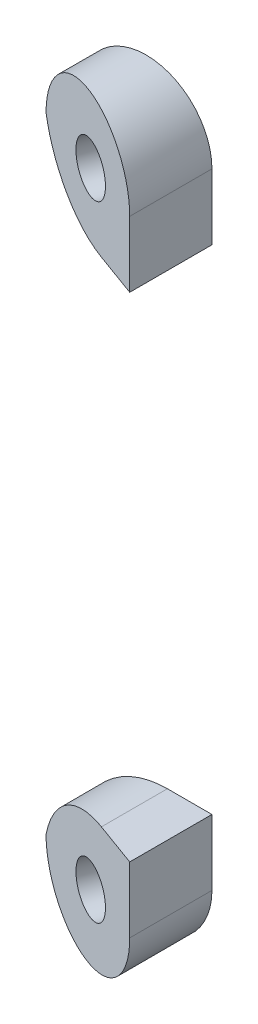
ISO-10303-21;
HEADER;
FILE_DESCRIPTION(('STEP AP214'),'2;1');
FILE_NAME('part.step','',(''),(''),'','','');
FILE_SCHEMA(('AUTOMOTIVE_DESIGN { 1 0 10303 214 1 1 1 1 }'));
ENDSEC;
DATA;
#1=APPLICATION_CONTEXT('core data for automotive mechanical design processes');
#2=APPLICATION_PROTOCOL_DEFINITION('international standard','automotive_design',2000,#1);
#3=PRODUCT_CONTEXT('',#1,'mechanical');
#4=PRODUCT('Part','Part','',(#3));
#5=PRODUCT_RELATED_PRODUCT_CATEGORY('part','',(#4));
#6=PRODUCT_DEFINITION_FORMATION('','',#4);
#7=PRODUCT_DEFINITION_CONTEXT('part definition',#1,'design');
#8=PRODUCT_DEFINITION('design','',#6,#7);
#9=PRODUCT_DEFINITION_SHAPE('','',#8);
#10=(LENGTH_UNIT() NAMED_UNIT(*) SI_UNIT(.MILLI.,.METRE.));
#11=(NAMED_UNIT(*) PLANE_ANGLE_UNIT() SI_UNIT($,.RADIAN.));
#12=(NAMED_UNIT(*) SI_UNIT($,.STERADIAN.) SOLID_ANGLE_UNIT());
#13=UNCERTAINTY_MEASURE_WITH_UNIT(LENGTH_MEASURE(1.E-05),#10,'distance_accuracy_value','');
#14=(GEOMETRIC_REPRESENTATION_CONTEXT(3) GLOBAL_UNCERTAINTY_ASSIGNED_CONTEXT((#13)) GLOBAL_UNIT_ASSIGNED_CONTEXT((#10,
#11,#12)) REPRESENTATION_CONTEXT('',''));
#15=CARTESIAN_POINT('',(0.,0.,0.));
#16=DIRECTION('',(0.,0.,1.));
#17=DIRECTION('',(1.,0.,0.));
#18=AXIS2_PLACEMENT_3D('',#15,#16,#17);
#19=CARTESIAN_POINT('',(89.2769045458306,-15.,-0.01));
#20=DIRECTION('',(0.,-1.,0.));
#21=DIRECTION('',(1.,0.,0.));
#22=AXIS2_PLACEMENT_3D('',#19,#20,#21);
#23=PLANE('',#22);
#24=DIRECTION('',(1.,0.,0.));
#25=VECTOR('',#24,1.);
#26=CARTESIAN_POINT('',(68.3945900393653,-15.,0.));
#27=LINE('',#26,#25);
#28=CARTESIAN_POINT('',(69.6860926614945,-15.,0.));
#29=VERTEX_POINT('',#28);
#30=CARTESIAN_POINT('',(72.3945900393653,-15.,0.));
#31=VERTEX_POINT('',#30);
#32=EDGE_CURVE('E80',#29,#31,#27,.T.);
#33=ORIENTED_EDGE('',*,*,#32,.F.);
#34=DIRECTION('',(0.,0.,-1.));
#35=VECTOR('',#34,1.);
#36=CARTESIAN_POINT('',(69.6860926614945,-15.,-0.01));
#37=LINE('',#36,#35);
#38=CARTESIAN_POINT('',(69.6860926614945,-15.,4.01418757486695));
#39=VERTEX_POINT('',#38);
#40=EDGE_CURVE('E50',#29,#39,#37,.F.);
#41=ORIENTED_EDGE('',*,*,#40,.T.);
#42=DIRECTION('',(-0.939692620785907,0.,-0.342020143325672));
#43=VECTOR('',#42,1.);
#44=CARTESIAN_POINT('',(72.3945900393653,-15.,5.));
#45=LINE('',#44,#43);
#46=CARTESIAN_POINT('',(72.3945900393653,-15.,5.));
#47=VERTEX_POINT('',#46);
#48=EDGE_CURVE('E85',#47,#39,#45,.T.);
#49=ORIENTED_EDGE('',*,*,#48,.F.);
#50=DIRECTION('',(0.,0.,1.));
#51=VECTOR('',#50,1.);
#52=CARTESIAN_POINT('',(72.3945900393653,-15.,5.));
#53=LINE('',#52,#51);
#54=EDGE_CURVE('E86',#31,#47,#53,.T.);
#55=ORIENTED_EDGE('',*,*,#54,.F.);
#56=EDGE_LOOP('',(#33,#41,#49,#55));
#57=FACE_BOUND('',#56,.T.);
#58=ADVANCED_FACE('F42',(#57),#23,.F.);
#59=CARTESIAN_POINT('',(72.3945900393653,19.,5.));
#60=DIRECTION('',(-1.,0.,0.));
#61=DIRECTION('',(0.,0.,1.));
#62=AXIS2_PLACEMENT_3D('',#59,#60,#61);
#63=PLANE('',#62);
#64=DIRECTION('',(0.,1.,0.));
#65=VECTOR('',#64,1.);
#66=CARTESIAN_POINT('',(72.3945900393653,19.,0.));
#67=LINE('',#66,#65);
#68=CARTESIAN_POINT('',(72.3945900393653,-19.,0.));
#69=VERTEX_POINT('',#68);
#70=EDGE_CURVE('E84',#69,#31,#67,.T.);
#71=ORIENTED_EDGE('',*,*,#70,.T.);
#72=ORIENTED_EDGE('',*,*,#54,.T.);
#73=DIRECTION('',(0.,1.,0.));
#74=VECTOR('',#73,1.);
#75=CARTESIAN_POINT('',(72.3945900393653,19.,5.));
#76=LINE('',#75,#74);
#77=CARTESIAN_POINT('',(72.3945900393653,-19.,5.));
#78=VERTEX_POINT('',#77);
#79=EDGE_CURVE('E97',#78,#47,#76,.T.);
#80=ORIENTED_EDGE('',*,*,#79,.F.);
#81=DIRECTION('',(0.,0.,-1.));
#82=VECTOR('',#81,1.);
#83=CARTESIAN_POINT('',(72.3945900393653,-19.,5.));
#84=LINE('',#83,#82);
#85=EDGE_CURVE('E95',#78,#69,#84,.T.);
#86=ORIENTED_EDGE('',*,*,#85,.T.);
#87=EDGE_LOOP('',(#71,#72,#80,#86));
#88=FACE_BOUND('',#87,.T.);
#89=ADVANCED_FACE('F93',(#88),#63,.F.);
#90=CARTESIAN_POINT('',(68.3945900393653,19.,0.));
#91=DIRECTION('',(0.,0.,1.));
#92=DIRECTION('',(1.,0.,0.));
#93=AXIS2_PLACEMENT_3D('',#90,#91,#92);
#94=PLANE('',#93);
#95=CARTESIAN_POINT('',(69.9908566980782,-19.0000000000012,0.));
#96=DIRECTION('',(0.,0.,1.));
#97=DIRECTION('',(-1.,0.,0.));
#98=AXIS2_PLACEMENT_3D('',#95,#96,#97);
#99=ELLIPSE('',#98,1.59626665871385,1.49999999999998);
#100=CARTESIAN_POINT('',(68.3945900393643,-19.0000000000012,0.));
#101=VERTEX_POINT('',#100);
#102=EDGE_CURVE('E106',#101,#101,#99,.T.);
#103=ORIENTED_EDGE('',*,*,#102,.T.);
#104=EDGE_LOOP('',(#103));
#105=FACE_BOUND('',#104,.T.);
#106=CARTESIAN_POINT('',(68.3945900393653,-19.,0.));
#107=DIRECTION('',(0.,0.,1.));
#108=DIRECTION('',(1.,0.,0.));
#109=AXIS2_PLACEMENT_3D('',#106,#107,#108);
#110=CIRCLE('',#109,4.);
#111=CARTESIAN_POINT('',(64.3945900393653,-19.,0.));
#112=VERTEX_POINT('',#111);
#113=EDGE_CURVE('E96',#112,#69,#110,.T.);
#114=ORIENTED_EDGE('',*,*,#113,.F.);
#115=CARTESIAN_POINT('',(69.6860926614945,-20.5,0.));
#116=DIRECTION('',(0.,0.,1.));
#117=DIRECTION('',(1.,0.,0.));
#118=AXIS2_PLACEMENT_3D('',#115,#116,#117);
#119=CIRCLE('',#118,5.5);
#120=EDGE_CURVE('E64',#112,#29,#119,.F.);
#121=ORIENTED_EDGE('',*,*,#120,.T.);
#122=ORIENTED_EDGE('',*,*,#32,.T.);
#123=ORIENTED_EDGE('',*,*,#70,.F.);
#124=EDGE_LOOP('',(#114,#121,#122,#123));
#125=FACE_BOUND('',#124,.T.);
#126=ADVANCED_FACE('F82',(#105,#125),#94,.F.);
#127=CARTESIAN_POINT('',(72.3945900393653,-23.,5.));
#128=DIRECTION('',(0.342020143325672,0.,-0.939692620785907));
#129=DIRECTION('',(-0.939692620785907,0.,-0.342020143325672));
#130=AXIS2_PLACEMENT_3D('',#127,#128,#129);
#131=PLANE('',#130);
#132=CARTESIAN_POINT('',(68.665071060089,-19.0000000000012,3.64256610341254));
#133=DIRECTION('',(-0.342020143325673,0.,0.939692620785907));
#134=DIRECTION('',(0.939692620785907,0.,0.342020143325673));
#135=AXIS2_PLACEMENT_3D('',#132,#133,#134);
#136=CIRCLE('',#135,1.49999999999998);
#137=CARTESIAN_POINT('',(70.0746099912678,-19.0000000000012,4.15559631840105));
#138=VERTEX_POINT('',#137);
#139=EDGE_CURVE('E104',#138,#138,#136,.T.);
#140=ORIENTED_EDGE('',*,*,#139,.F.);
#141=EDGE_LOOP('',(#140));
#142=FACE_BOUND('',#141,.T.);
#143=ORIENTED_EDGE('',*,*,#48,.T.);
#144=CARTESIAN_POINT('',(69.6860926614945,-20.5,4.01418757486695));
#145=DIRECTION('',(0.342020143325672,0.,-0.939692620785907));
#146=DIRECTION('',(-0.939692620785907,0.,-0.342020143325672));
#147=AXIS2_PLACEMENT_3D('',#144,#145,#146);
#148=ELLIPSE('',#147,5.85297774861752,5.5);
#149=CARTESIAN_POINT('',(64.3945900393653,-19.,2.08823812587035));
#150=VERTEX_POINT('',#149);
#151=EDGE_CURVE('E12',#39,#150,#148,.F.);
#152=ORIENTED_EDGE('',*,*,#151,.T.);
#153=CARTESIAN_POINT('',(68.3945900393653,-19.,3.54411906293517));
#154=DIRECTION('',(0.342020143325672,0.,-0.939692620785907));
#155=DIRECTION('',(-0.939692620785907,0.,-0.342020143325672));
#156=AXIS2_PLACEMENT_3D('',#153,#154,#155);
#157=ELLIPSE('',#156,4.25671108990365,4.);
#158=EDGE_CURVE('E99',#78,#150,#157,.T.);
#159=ORIENTED_EDGE('',*,*,#158,.F.);
#160=ORIENTED_EDGE('',*,*,#79,.T.);
#161=EDGE_LOOP('',(#143,#152,#159,#160));
#162=FACE_BOUND('',#161,.T.);
#163=ADVANCED_FACE('F120',(#142,#162),#131,.F.);
#164=CARTESIAN_POINT('',(68.3945900393653,-19.,5.));
#165=DIRECTION('',(0.,0.,-1.));
#166=DIRECTION('',(-1.,0.,0.));
#167=AXIS2_PLACEMENT_3D('',#164,#165,#166);
#168=CYLINDRICAL_SURFACE('',#167,4.);
#169=ORIENTED_EDGE('',*,*,#85,.F.);
#170=ORIENTED_EDGE('',*,*,#158,.T.);
#171=DIRECTION('',(0.,0.,-1.));
#172=VECTOR('',#171,1.);
#173=CARTESIAN_POINT('',(64.3945900393653,-19.,5.));
#174=LINE('',#173,#172);
#175=EDGE_CURVE('E115',#150,#112,#174,.T.);
#176=ORIENTED_EDGE('',*,*,#175,.T.);
#177=ORIENTED_EDGE('',*,*,#113,.T.);
#178=EDGE_LOOP('',(#169,#170,#176,#177));
#179=FACE_BOUND('',#178,.T.);
#180=ADVANCED_FACE('F124',(#179),#168,.T.);
#181=CARTESIAN_POINT('',(99.7889041027252,-19.0000000000012,-81.869462388105));
#182=DIRECTION('',(-0.342020143325673,0.,0.939692620785907));
#183=DIRECTION('',(0.939692620785907,0.,0.342020143325673));
#184=AXIS2_PLACEMENT_3D('',#181,#182,#183);
#185=CYLINDRICAL_SURFACE('',#184,1.49999999999998);
#186=ORIENTED_EDGE('',*,*,#139,.T.);
#187=EDGE_LOOP('',(#186));
#188=FACE_BOUND('',#187,.T.);
#189=ORIENTED_EDGE('',*,*,#102,.F.);
#190=EDGE_LOOP('',(#189));
#191=FACE_BOUND('',#190,.T.);
#192=ADVANCED_FACE('F126',(#188,#191),#185,.F.);
#193=CARTESIAN_POINT('',(69.6860926614945,-20.5,5.));
#194=DIRECTION('',(0.,0.,-1.));
#195=DIRECTION('',(-1.,0.,0.));
#196=AXIS2_PLACEMENT_3D('',#193,#194,#195);
#197=CYLINDRICAL_SURFACE('',#196,5.5);
#198=ORIENTED_EDGE('',*,*,#151,.F.);
#199=ORIENTED_EDGE('',*,*,#40,.F.);
#200=ORIENTED_EDGE('',*,*,#120,.F.);
#201=ORIENTED_EDGE('',*,*,#175,.F.);
#202=EDGE_LOOP('',(#198,#199,#200,#201));
#203=FACE_BOUND('',#202,.T.);
#204=ADVANCED_FACE('F44',(#203),#197,.T.);
#205=CLOSED_SHELL('',(#58,#89,#126,#163,#180,#192,#204));
#206=MANIFOLD_SOLID_BREP('B2',#205);
#207=CARTESIAN_POINT('',(89.2769045458306,15.,-0.01));
#208=DIRECTION('',(0.,1.,0.));
#209=DIRECTION('',(-1.,0.,0.));
#210=AXIS2_PLACEMENT_3D('',#207,#208,#209);
#211=PLANE('',#210);
#212=DIRECTION('',(0.939692620785907,0.,0.342020143325672));
#213=VECTOR('',#212,1.);
#214=CARTESIAN_POINT('',(72.3945900393653,15.,5.));
#215=LINE('',#214,#213);
#216=CARTESIAN_POINT('',(69.6860926614945,15.,4.01418757486695));
#217=VERTEX_POINT('',#216);
#218=CARTESIAN_POINT('',(72.3945900393653,15.,5.));
#219=VERTEX_POINT('',#218);
#220=EDGE_CURVE('E243',#217,#219,#215,.T.);
#221=ORIENTED_EDGE('',*,*,#220,.F.);
#222=DIRECTION('',(0.,0.,-1.));
#223=VECTOR('',#222,1.);
#224=CARTESIAN_POINT('',(69.6860926614945,15.,-0.01));
#225=LINE('',#224,#223);
#226=CARTESIAN_POINT('',(69.6860926614945,15.,0.));
#227=VERTEX_POINT('',#226);
#228=EDGE_CURVE('E194',#217,#227,#225,.T.);
#229=ORIENTED_EDGE('',*,*,#228,.T.);
#230=DIRECTION('',(-1.,0.,0.));
#231=VECTOR('',#230,1.);
#232=CARTESIAN_POINT('',(68.3945900393653,15.,0.));
#233=LINE('',#232,#231);
#234=CARTESIAN_POINT('',(72.3945900393653,15.,0.));
#235=VERTEX_POINT('',#234);
#236=EDGE_CURVE('E246',#235,#227,#233,.T.);
#237=ORIENTED_EDGE('',*,*,#236,.F.);
#238=DIRECTION('',(0.,0.,-1.));
#239=VECTOR('',#238,1.);
#240=CARTESIAN_POINT('',(72.3945900393653,15.,5.));
#241=LINE('',#240,#239);
#242=EDGE_CURVE('E227',#219,#235,#241,.T.);
#243=ORIENTED_EDGE('',*,*,#242,.F.);
#244=EDGE_LOOP('',(#221,#229,#237,#243));
#245=FACE_BOUND('',#244,.T.);
#246=ADVANCED_FACE('F186',(#245),#211,.F.);
#247=CARTESIAN_POINT('',(68.3945900393653,19.,5.));
#248=DIRECTION('',(0.,0.,-1.));
#249=DIRECTION('',(-1.,0.,0.));
#250=AXIS2_PLACEMENT_3D('',#247,#248,#249);
#251=CYLINDRICAL_SURFACE('',#250,4.);
#252=DIRECTION('',(0.,0.,-1.));
#253=VECTOR('',#252,1.);
#254=CARTESIAN_POINT('',(64.3945900393653,19.,5.));
#255=LINE('',#254,#253);
#256=CARTESIAN_POINT('',(64.3945900393653,19.,2.08823812587035));
#257=VERTEX_POINT('',#256);
#258=CARTESIAN_POINT('',(64.3945900393653,19.,0.));
#259=VERTEX_POINT('',#258);
#260=EDGE_CURVE('E226',#257,#259,#255,.T.);
#261=ORIENTED_EDGE('',*,*,#260,.F.);
#262=CARTESIAN_POINT('',(68.3945900393653,19.,3.54411906293517));
#263=DIRECTION('',(0.342020143325672,0.,-0.939692620785907));
#264=DIRECTION('',(-0.939692620785907,0.,-0.342020143325672));
#265=AXIS2_PLACEMENT_3D('',#262,#263,#264);
#266=ELLIPSE('',#265,4.25671108990365,4.);
#267=CARTESIAN_POINT('',(72.3945900393653,19.,5.));
#268=VERTEX_POINT('',#267);
#269=EDGE_CURVE('E230',#257,#268,#266,.T.);
#270=ORIENTED_EDGE('',*,*,#269,.T.);
#271=DIRECTION('',(0.,0.,-1.));
#272=VECTOR('',#271,1.);
#273=CARTESIAN_POINT('',(72.3945900393653,19.,5.));
#274=LINE('',#273,#272);
#275=CARTESIAN_POINT('',(72.3945900393653,19.,0.));
#276=VERTEX_POINT('',#275);
#277=EDGE_CURVE('E244',#268,#276,#274,.T.);
#278=ORIENTED_EDGE('',*,*,#277,.T.);
#279=CARTESIAN_POINT('',(68.3945900393653,19.,0.));
#280=DIRECTION('',(0.,0.,1.));
#281=DIRECTION('',(1.,0.,0.));
#282=AXIS2_PLACEMENT_3D('',#279,#280,#281);
#283=CIRCLE('',#282,4.);
#284=EDGE_CURVE('E237',#276,#259,#283,.T.);
#285=ORIENTED_EDGE('',*,*,#284,.T.);
#286=EDGE_LOOP('',(#261,#270,#278,#285));
#287=FACE_BOUND('',#286,.T.);
#288=ADVANCED_FACE('F241',(#287),#251,.T.);
#289=CARTESIAN_POINT('',(72.3945900393653,19.,5.));
#290=DIRECTION('',(-1.,0.,0.));
#291=DIRECTION('',(0.,0.,1.));
#292=AXIS2_PLACEMENT_3D('',#289,#290,#291);
#293=PLANE('',#292);
#294=DIRECTION('',(0.,1.,0.));
#295=VECTOR('',#294,1.);
#296=CARTESIAN_POINT('',(72.3945900393653,19.,5.));
#297=LINE('',#296,#295);
#298=EDGE_CURVE('E233',#219,#268,#297,.T.);
#299=ORIENTED_EDGE('',*,*,#298,.F.);
#300=ORIENTED_EDGE('',*,*,#242,.T.);
#301=DIRECTION('',(0.,1.,0.));
#302=VECTOR('',#301,1.);
#303=CARTESIAN_POINT('',(72.3945900393653,19.,0.));
#304=LINE('',#303,#302);
#305=EDGE_CURVE('E256',#235,#276,#304,.T.);
#306=ORIENTED_EDGE('',*,*,#305,.T.);
#307=ORIENTED_EDGE('',*,*,#277,.F.);
#308=EDGE_LOOP('',(#299,#300,#306,#307));
#309=FACE_BOUND('',#308,.T.);
#310=ADVANCED_FACE('F259',(#309),#293,.F.);
#311=CARTESIAN_POINT('',(99.788904102726,18.9999999999988,-81.8694623881047));
#312=DIRECTION('',(-0.342020143325673,0.,0.939692620785907));
#313=DIRECTION('',(0.939692620785907,0.,0.342020143325673));
#314=AXIS2_PLACEMENT_3D('',#311,#312,#313);
#315=CYLINDRICAL_SURFACE('',#314,1.5);
#316=CARTESIAN_POINT('',(68.6650710600898,18.9999999999988,3.64256610341285));
#317=DIRECTION('',(-0.342020143325673,0.,0.939692620785907));
#318=DIRECTION('',(0.939692620785907,0.,0.342020143325673));
#319=AXIS2_PLACEMENT_3D('',#316,#317,#318);
#320=CIRCLE('',#319,1.5);
#321=CARTESIAN_POINT('',(70.0746099912687,18.9999999999988,4.15559631840136));
#322=VERTEX_POINT('',#321);
#323=EDGE_CURVE('E265',#322,#322,#320,.T.);
#324=ORIENTED_EDGE('',*,*,#323,.T.);
#325=EDGE_LOOP('',(#324));
#326=FACE_BOUND('',#325,.T.);
#327=CARTESIAN_POINT('',(69.9908566980791,18.9999999999988,0.));
#328=DIRECTION('',(0.,0.,1.));
#329=DIRECTION('',(-1.,0.,0.));
#330=AXIS2_PLACEMENT_3D('',#327,#328,#329);
#331=ELLIPSE('',#330,1.59626665871387,1.5);
#332=CARTESIAN_POINT('',(68.3945900393653,18.9999999999988,0.));
#333=VERTEX_POINT('',#332);
#334=EDGE_CURVE('E238',#333,#333,#331,.T.);
#335=ORIENTED_EDGE('',*,*,#334,.F.);
#336=EDGE_LOOP('',(#335));
#337=FACE_BOUND('',#336,.T.);
#338=ADVANCED_FACE('F269',(#326,#337),#315,.F.);
#339=CARTESIAN_POINT('',(72.3945900393653,-23.,5.));
#340=DIRECTION('',(0.342020143325672,0.,-0.939692620785907));
#341=DIRECTION('',(-0.939692620785907,0.,-0.342020143325672));
#342=AXIS2_PLACEMENT_3D('',#339,#340,#341);
#343=PLANE('',#342);
#344=ORIENTED_EDGE('',*,*,#323,.F.);
#345=EDGE_LOOP('',(#344));
#346=FACE_BOUND('',#345,.T.);
#347=ORIENTED_EDGE('',*,*,#269,.F.);
#348=CARTESIAN_POINT('',(69.6860926614945,20.5,4.01418757486695));
#349=DIRECTION('',(0.342020143325672,0.,-0.939692620785907));
#350=DIRECTION('',(-0.939692620785907,0.,-0.342020143325672));
#351=AXIS2_PLACEMENT_3D('',#348,#349,#350);
#352=ELLIPSE('',#351,5.85297774861752,5.5);
#353=EDGE_CURVE('E208',#257,#217,#352,.F.);
#354=ORIENTED_EDGE('',*,*,#353,.T.);
#355=ORIENTED_EDGE('',*,*,#220,.T.);
#356=ORIENTED_EDGE('',*,*,#298,.T.);
#357=EDGE_LOOP('',(#347,#354,#355,#356));
#358=FACE_BOUND('',#357,.T.);
#359=ADVANCED_FACE('F231',(#346,#358),#343,.F.);
#360=CARTESIAN_POINT('',(68.3945900393653,19.,0.));
#361=DIRECTION('',(0.,0.,1.));
#362=DIRECTION('',(1.,0.,0.));
#363=AXIS2_PLACEMENT_3D('',#360,#361,#362);
#364=PLANE('',#363);
#365=ORIENTED_EDGE('',*,*,#334,.T.);
#366=EDGE_LOOP('',(#365));
#367=FACE_BOUND('',#366,.T.);
#368=ORIENTED_EDGE('',*,*,#236,.T.);
#369=CARTESIAN_POINT('',(69.6860926614945,20.5,0.));
#370=DIRECTION('',(0.,0.,1.));
#371=DIRECTION('',(1.,0.,0.));
#372=AXIS2_PLACEMENT_3D('',#369,#370,#371);
#373=CIRCLE('',#372,5.5);
#374=EDGE_CURVE('E40',#227,#259,#373,.F.);
#375=ORIENTED_EDGE('',*,*,#374,.T.);
#376=ORIENTED_EDGE('',*,*,#284,.F.);
#377=ORIENTED_EDGE('',*,*,#305,.F.);
#378=EDGE_LOOP('',(#368,#375,#376,#377));
#379=FACE_BOUND('',#378,.T.);
#380=ADVANCED_FACE('F255',(#367,#379),#364,.F.);
#381=CARTESIAN_POINT('',(69.6860926614945,20.5,5.));
#382=DIRECTION('',(0.,0.,-1.));
#383=DIRECTION('',(-1.,0.,0.));
#384=AXIS2_PLACEMENT_3D('',#381,#382,#383);
#385=CYLINDRICAL_SURFACE('',#384,5.5);
#386=ORIENTED_EDGE('',*,*,#374,.F.);
#387=ORIENTED_EDGE('',*,*,#228,.F.);
#388=ORIENTED_EDGE('',*,*,#353,.F.);
#389=ORIENTED_EDGE('',*,*,#260,.T.);
#390=EDGE_LOOP('',(#386,#387,#388,#389));
#391=FACE_BOUND('',#390,.T.);
#392=ADVANCED_FACE('F188',(#391),#385,.T.);
#393=CLOSED_SHELL('',(#246,#288,#310,#338,#359,#380,#392));
#394=MANIFOLD_SOLID_BREP('B6',#393);
#395=ADVANCED_BREP_SHAPE_REPRESENTATION('',(#18,#206,#394),#14);
#396=SHAPE_DEFINITION_REPRESENTATION(#9,#395);
ENDSEC;
END-ISO-10303-21;
